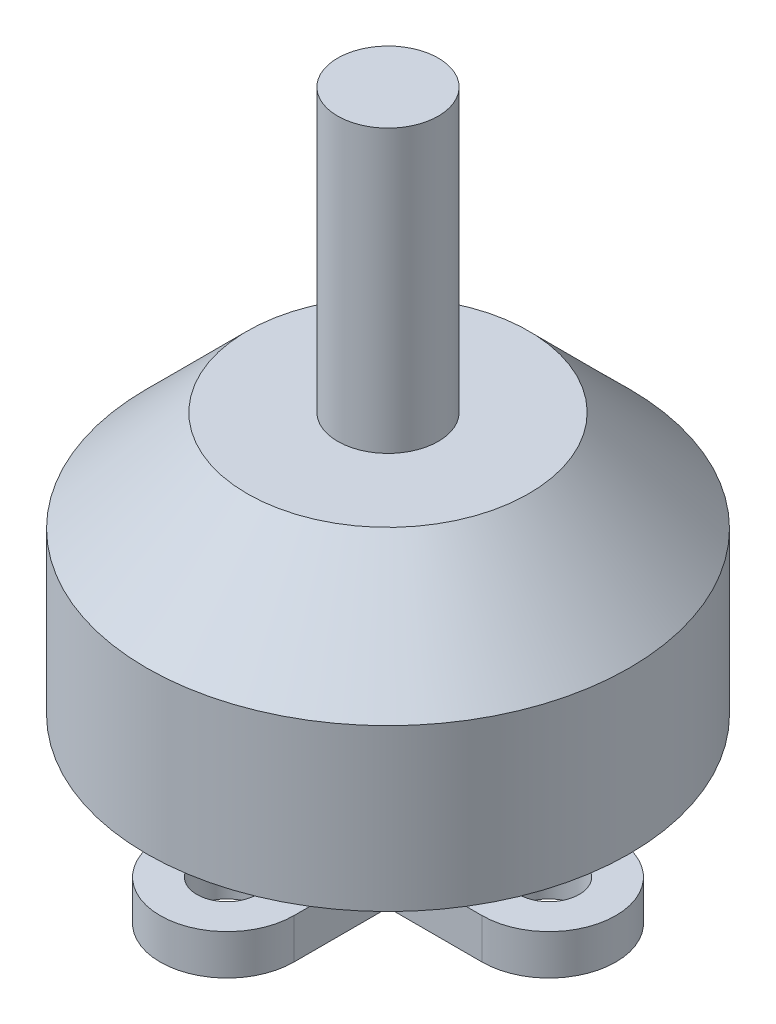
ISO-10303-21;
HEADER;
FILE_DESCRIPTION(('STEP AP214'),'2;1');
FILE_NAME('part.step','',(''),(''),'','','');
FILE_SCHEMA(('AUTOMOTIVE_DESIGN { 1 0 10303 214 1 1 1 1 }'));
ENDSEC;
DATA;
#1=APPLICATION_CONTEXT('core data for automotive mechanical design processes');
#2=APPLICATION_PROTOCOL_DEFINITION('international standard','automotive_design',2000,#1);
#3=PRODUCT_CONTEXT('',#1,'mechanical');
#4=PRODUCT('Part','Part','',(#3));
#5=PRODUCT_RELATED_PRODUCT_CATEGORY('part','',(#4));
#6=PRODUCT_DEFINITION_FORMATION('','',#4);
#7=PRODUCT_DEFINITION_CONTEXT('part definition',#1,'design');
#8=PRODUCT_DEFINITION('design','',#6,#7);
#9=PRODUCT_DEFINITION_SHAPE('','',#8);
#10=(LENGTH_UNIT() NAMED_UNIT(*) SI_UNIT(.MILLI.,.METRE.));
#11=(NAMED_UNIT(*) PLANE_ANGLE_UNIT() SI_UNIT($,.RADIAN.));
#12=(NAMED_UNIT(*) SI_UNIT($,.STERADIAN.) SOLID_ANGLE_UNIT());
#13=UNCERTAINTY_MEASURE_WITH_UNIT(LENGTH_MEASURE(1.E-05),#10,'distance_accuracy_value','');
#14=(GEOMETRIC_REPRESENTATION_CONTEXT(3) GLOBAL_UNCERTAINTY_ASSIGNED_CONTEXT((#13)) GLOBAL_UNIT_ASSIGNED_CONTEXT((#10,
#11,#12)) REPRESENTATION_CONTEXT('',''));
#15=CARTESIAN_POINT('',(0.,0.,0.));
#16=DIRECTION('',(0.,0.,1.));
#17=DIRECTION('',(1.,0.,0.));
#18=AXIS2_PLACEMENT_3D('',#15,#16,#17);
#19=CARTESIAN_POINT('',(0.,2.,0.));
#20=DIRECTION('',(0.,1.,0.));
#21=DIRECTION('',(0.,0.,1.));
#22=AXIS2_PLACEMENT_3D('',#19,#20,#21);
#23=PLANE('',#22);
#24=CARTESIAN_POINT('',(0.,2.,0.));
#25=DIRECTION('',(0.,1.,0.));
#26=DIRECTION('',(0.,0.,1.));
#27=AXIS2_PLACEMENT_3D('',#24,#25,#26);
#28=CIRCLE('',#27,4.6954962251594);
#29=CARTESIAN_POINT('',(3.320217221846,2.,3.32021722184609));
#30=VERTEX_POINT('',#29);
#31=CARTESIAN_POINT('',(3.32021722184605,2.,-3.32021722184604));
#32=VERTEX_POINT('',#31);
#33=EDGE_CURVE('E150',#30,#32,#28,.T.);
#34=ORIENTED_EDGE('',*,*,#33,.F.);
#35=DIRECTION('',(-1.,0.,0.));
#36=VECTOR('',#35,1.);
#37=CARTESIAN_POINT('',(0.,2.,3.32021722184614));
#38=LINE('',#37,#36);
#39=CARTESIAN_POINT('',(7.99999999999994,2.,3.32021722184594));
#40=VERTEX_POINT('',#39);
#41=EDGE_CURVE('E200',#40,#30,#38,.T.);
#42=ORIENTED_EDGE('',*,*,#41,.F.);
#43=CARTESIAN_POINT('',(8.,2.,0.));
#44=DIRECTION('',(0.,1.,0.));
#45=DIRECTION('',(0.,0.,1.));
#46=AXIS2_PLACEMENT_3D('',#43,#44,#45);
#47=CIRCLE('',#46,3.32021722184605);
#48=CARTESIAN_POINT('',(8.00000000000006,2.,-3.32021722184616));
#49=VERTEX_POINT('',#48);
#50=EDGE_CURVE('E202',#40,#49,#47,.T.);
#51=ORIENTED_EDGE('',*,*,#50,.T.);
#52=DIRECTION('',(-1.,0.,0.));
#53=VECTOR('',#52,1.);
#54=CARTESIAN_POINT('',(0.,2.,-3.32021722184596));
#55=LINE('',#54,#53);
#56=EDGE_CURVE('E205',#49,#32,#55,.T.);
#57=ORIENTED_EDGE('',*,*,#56,.T.);
#58=EDGE_LOOP('',(#34,#42,#51,#57));
#59=FACE_BOUND('',#58,.T.);
#60=CARTESIAN_POINT('',(8.,2.,0.));
#61=DIRECTION('',(0.,1.,0.));
#62=DIRECTION('',(0.,0.,1.));
#63=AXIS2_PLACEMENT_3D('',#60,#61,#62);
#64=CIRCLE('',#63,1.5);
#65=CARTESIAN_POINT('',(8.,2.,1.50000000000006));
#66=VERTEX_POINT('',#65);
#67=EDGE_CURVE('E194',#66,#66,#64,.T.);
#68=ORIENTED_EDGE('',*,*,#67,.F.);
#69=EDGE_LOOP('',(#68));
#70=FACE_BOUND('',#69,.T.);
#71=ADVANCED_FACE('F40',(#59,#70),#23,.T.);
#72=CARTESIAN_POINT('',(-3.32021722184605,2.,-3.32021722184611));
#73=VERTEX_POINT('',#72);
#74=EDGE_CURVE('E181',#32,#73,#28,.T.);
#75=ORIENTED_EDGE('',*,*,#74,.F.);
#76=DIRECTION('',(0.,0.,-1.));
#77=VECTOR('',#76,1.);
#78=CARTESIAN_POINT('',(3.32021722184602,2.,0.));
#79=LINE('',#78,#77);
#80=CARTESIAN_POINT('',(3.32021722184619,2.,-7.99999999999995));
#81=VERTEX_POINT('',#80);
#82=EDGE_CURVE('E208',#32,#81,#79,.T.);
#83=ORIENTED_EDGE('',*,*,#82,.T.);
#84=CARTESIAN_POINT('',(0.,2.,-8.));
#85=DIRECTION('',(0.,1.,0.));
#86=DIRECTION('',(0.,0.,1.));
#87=AXIS2_PLACEMENT_3D('',#84,#85,#86);
#88=CIRCLE('',#87,3.32021722184605);
#89=CARTESIAN_POINT('',(-3.32021722184591,2.,-8.00000000000004));
#90=VERTEX_POINT('',#89);
#91=EDGE_CURVE('E211',#81,#90,#88,.T.);
#92=ORIENTED_EDGE('',*,*,#91,.T.);
#93=DIRECTION('',(0.,0.,1.));
#94=VECTOR('',#93,1.);
#95=CARTESIAN_POINT('',(-3.32021722184616,2.,-1.02521717049406E-13));
#96=LINE('',#95,#94);
#97=EDGE_CURVE('E214',#90,#73,#96,.T.);
#98=ORIENTED_EDGE('',*,*,#97,.T.);
#99=EDGE_LOOP('',(#75,#83,#92,#98));
#100=FACE_BOUND('',#99,.T.);
#101=CARTESIAN_POINT('',(0.,2.,-8.));
#102=DIRECTION('',(0.,1.,0.));
#103=DIRECTION('',(0.,0.,1.));
#104=AXIS2_PLACEMENT_3D('',#101,#102,#103);
#105=CIRCLE('',#104,1.5);
#106=CARTESIAN_POINT('',(0.,2.,-6.5));
#107=VERTEX_POINT('',#106);
#108=EDGE_CURVE('E191',#107,#107,#105,.T.);
#109=ORIENTED_EDGE('',*,*,#108,.F.);
#110=EDGE_LOOP('',(#109));
#111=FACE_BOUND('',#110,.T.);
#112=ADVANCED_FACE('F311',(#100,#111),#23,.T.);
#113=CARTESIAN_POINT('',(-3.3202172218461,2.,3.32021722184599));
#114=VERTEX_POINT('',#113);
#115=EDGE_CURVE('E148',#73,#114,#28,.T.);
#116=ORIENTED_EDGE('',*,*,#115,.F.);
#117=DIRECTION('',(-1.,0.,0.));
#118=VECTOR('',#117,1.);
#119=CARTESIAN_POINT('',(0.,2.,-3.32021722184608));
#120=LINE('',#119,#118);
#121=CARTESIAN_POINT('',(-7.99999999999997,2.,-3.32021722184616));
#122=VERTEX_POINT('',#121);
#123=EDGE_CURVE('E217',#73,#122,#120,.T.);
#124=ORIENTED_EDGE('',*,*,#123,.T.);
#125=CARTESIAN_POINT('',(-8.,2.,-1.1172740284298E-13));
#126=DIRECTION('',(0.,1.,0.));
#127=DIRECTION('',(0.,0.,1.));
#128=AXIS2_PLACEMENT_3D('',#125,#126,#127);
#129=CIRCLE('',#128,3.32021722184605);
#130=CARTESIAN_POINT('',(-8.00000000000004,2.,3.32021722184594));
#131=VERTEX_POINT('',#130);
#132=EDGE_CURVE('E170',#122,#131,#129,.T.);
#133=ORIENTED_EDGE('',*,*,#132,.T.);
#134=DIRECTION('',(1.,0.,0.));
#135=VECTOR('',#134,1.);
#136=CARTESIAN_POINT('',(0.,2.,3.32021722184602));
#137=LINE('',#136,#135);
#138=EDGE_CURVE('E162',#131,#114,#137,.T.);
#139=ORIENTED_EDGE('',*,*,#138,.T.);
#140=EDGE_LOOP('',(#116,#124,#133,#139));
#141=FACE_BOUND('',#140,.T.);
#142=CARTESIAN_POINT('',(-8.,2.,0.));
#143=DIRECTION('',(0.,1.,0.));
#144=DIRECTION('',(0.,0.,1.));
#145=AXIS2_PLACEMENT_3D('',#142,#143,#144);
#146=CIRCLE('',#145,1.5);
#147=CARTESIAN_POINT('',(-8.,2.,1.5));
#148=VERTEX_POINT('',#147);
#149=EDGE_CURVE('E188',#148,#148,#146,.T.);
#150=ORIENTED_EDGE('',*,*,#149,.F.);
#151=EDGE_LOOP('',(#150));
#152=FACE_BOUND('',#151,.T.);
#153=ADVANCED_FACE('F166',(#141,#152),#23,.T.);
#154=CARTESIAN_POINT('',(0.,2.,3.32021722184614));
#155=DIRECTION('',(0.,0.,1.));
#156=DIRECTION('',(1.,0.,0.));
#157=AXIS2_PLACEMENT_3D('',#154,#155,#156);
#158=PLANE('',#157);
#159=DIRECTION('',(-1.,0.,0.));
#160=VECTOR('',#159,1.);
#161=CARTESIAN_POINT('',(0.,0.,3.32021722184614));
#162=LINE('',#161,#160);
#163=CARTESIAN_POINT('',(7.99999999999994,0.,3.32021722184594));
#164=VERTEX_POINT('',#163);
#165=CARTESIAN_POINT('',(3.320217221846,0.,3.32021722184606));
#166=VERTEX_POINT('',#165);
#167=EDGE_CURVE('E234',#164,#166,#162,.T.);
#168=ORIENTED_EDGE('',*,*,#167,.F.);
#169=DIRECTION('',(0.,-1.,0.));
#170=VECTOR('',#169,1.);
#171=CARTESIAN_POINT('',(7.99999999999994,2.,3.32021722184594));
#172=LINE('',#171,#170);
#173=EDGE_CURVE('E111',#40,#164,#172,.T.);
#174=ORIENTED_EDGE('',*,*,#173,.F.);
#175=ORIENTED_EDGE('',*,*,#41,.T.);
#176=DIRECTION('',(0.,-1.,0.));
#177=VECTOR('',#176,1.);
#178=CARTESIAN_POINT('',(3.320217221846,2.,3.32021722184606));
#179=LINE('',#178,#177);
#180=EDGE_CURVE('E107',#30,#166,#179,.T.);
#181=ORIENTED_EDGE('',*,*,#180,.T.);
#182=EDGE_LOOP('',(#168,#174,#175,#181));
#183=FACE_BOUND('',#182,.T.);
#184=ADVANCED_FACE('F332',(#183),#158,.T.);
#185=CARTESIAN_POINT('',(8.,2.,0.));
#186=DIRECTION('',(0.,-1.,0.));
#187=DIRECTION('',(0.,0.,-1.));
#188=AXIS2_PLACEMENT_3D('',#185,#186,#187);
#189=CYLINDRICAL_SURFACE('',#188,3.32021722184605);
#190=CARTESIAN_POINT('',(8.,0.,0.));
#191=DIRECTION('',(0.,1.,0.));
#192=DIRECTION('',(0.,0.,1.));
#193=AXIS2_PLACEMENT_3D('',#190,#191,#192);
#194=CIRCLE('',#193,3.32021722184605);
#195=CARTESIAN_POINT('',(8.00000000000006,0.,-3.32021722184616));
#196=VERTEX_POINT('',#195);
#197=EDGE_CURVE('E236',#164,#196,#194,.T.);
#198=ORIENTED_EDGE('',*,*,#197,.T.);
#199=DIRECTION('',(0.,-1.,0.));
#200=VECTOR('',#199,1.);
#201=CARTESIAN_POINT('',(8.00000000000006,2.,-3.32021722184616));
#202=LINE('',#201,#200);
#203=EDGE_CURVE('E284',#49,#196,#202,.T.);
#204=ORIENTED_EDGE('',*,*,#203,.F.);
#205=ORIENTED_EDGE('',*,*,#50,.F.);
#206=ORIENTED_EDGE('',*,*,#173,.T.);
#207=EDGE_LOOP('',(#198,#204,#205,#206));
#208=FACE_BOUND('',#207,.T.);
#209=ADVANCED_FACE('F336',(#208),#189,.T.);
#210=CARTESIAN_POINT('',(0.,2.,-3.32021722184596));
#211=DIRECTION('',(0.,0.,1.));
#212=DIRECTION('',(1.,0.,0.));
#213=AXIS2_PLACEMENT_3D('',#210,#211,#212);
#214=PLANE('',#213);
#215=DIRECTION('',(-1.,0.,0.));
#216=VECTOR('',#215,1.);
#217=CARTESIAN_POINT('',(0.,0.,-3.32021722184596));
#218=LINE('',#217,#216);
#219=CARTESIAN_POINT('',(3.32021722184605,0.,-3.32021722184604));
#220=VERTEX_POINT('',#219);
#221=EDGE_CURVE('E239',#196,#220,#218,.T.);
#222=ORIENTED_EDGE('',*,*,#221,.T.);
#223=DIRECTION('',(0.,-1.,0.));
#224=VECTOR('',#223,1.);
#225=CARTESIAN_POINT('',(3.32021722184605,2.,-3.32021722184604));
#226=LINE('',#225,#224);
#227=EDGE_CURVE('E281',#32,#220,#226,.T.);
#228=ORIENTED_EDGE('',*,*,#227,.F.);
#229=ORIENTED_EDGE('',*,*,#56,.F.);
#230=ORIENTED_EDGE('',*,*,#203,.T.);
#231=EDGE_LOOP('',(#222,#228,#229,#230));
#232=FACE_BOUND('',#231,.T.);
#233=ADVANCED_FACE('F341',(#232),#214,.F.);
#234=CARTESIAN_POINT('',(3.32021722184602,2.,0.));
#235=DIRECTION('',(-1.,0.,0.));
#236=DIRECTION('',(0.,0.,1.));
#237=AXIS2_PLACEMENT_3D('',#234,#235,#236);
#238=PLANE('',#237);
#239=DIRECTION('',(0.,0.,-1.));
#240=VECTOR('',#239,1.);
#241=CARTESIAN_POINT('',(3.32021722184602,0.,0.));
#242=LINE('',#241,#240);
#243=CARTESIAN_POINT('',(3.32021722184619,0.,-7.99999999999995));
#244=VERTEX_POINT('',#243);
#245=EDGE_CURVE('E242',#220,#244,#242,.T.);
#246=ORIENTED_EDGE('',*,*,#245,.T.);
#247=DIRECTION('',(0.,-1.,0.));
#248=VECTOR('',#247,1.);
#249=CARTESIAN_POINT('',(3.32021722184619,2.,-7.99999999999995));
#250=LINE('',#249,#248);
#251=EDGE_CURVE('E278',#81,#244,#250,.T.);
#252=ORIENTED_EDGE('',*,*,#251,.F.);
#253=ORIENTED_EDGE('',*,*,#82,.F.);
#254=ORIENTED_EDGE('',*,*,#227,.T.);
#255=EDGE_LOOP('',(#246,#252,#253,#254));
#256=FACE_BOUND('',#255,.T.);
#257=ADVANCED_FACE('F390',(#256),#238,.F.);
#258=CARTESIAN_POINT('',(0.,2.,-8.));
#259=DIRECTION('',(0.,-1.,0.));
#260=DIRECTION('',(0.,0.,-1.));
#261=AXIS2_PLACEMENT_3D('',#258,#259,#260);
#262=CYLINDRICAL_SURFACE('',#261,3.32021722184605);
#263=CARTESIAN_POINT('',(0.,0.,-8.));
#264=DIRECTION('',(0.,1.,0.));
#265=DIRECTION('',(0.,0.,1.));
#266=AXIS2_PLACEMENT_3D('',#263,#264,#265);
#267=CIRCLE('',#266,3.32021722184605);
#268=CARTESIAN_POINT('',(-3.32021722184591,0.,-8.00000000000004));
#269=VERTEX_POINT('',#268);
#270=EDGE_CURVE('E245',#244,#269,#267,.T.);
#271=ORIENTED_EDGE('',*,*,#270,.T.);
#272=DIRECTION('',(0.,-1.,0.));
#273=VECTOR('',#272,1.);
#274=CARTESIAN_POINT('',(-3.32021722184591,2.,-8.00000000000004));
#275=LINE('',#274,#273);
#276=EDGE_CURVE('E275',#90,#269,#275,.T.);
#277=ORIENTED_EDGE('',*,*,#276,.F.);
#278=ORIENTED_EDGE('',*,*,#91,.F.);
#279=ORIENTED_EDGE('',*,*,#251,.T.);
#280=EDGE_LOOP('',(#271,#277,#278,#279));
#281=FACE_BOUND('',#280,.T.);
#282=ADVANCED_FACE('F386',(#281),#262,.T.);
#283=CARTESIAN_POINT('',(-3.32021722184616,2.,-1.02521717049406E-13));
#284=DIRECTION('',(1.,0.,0.));
#285=DIRECTION('',(0.,0.,-1.));
#286=AXIS2_PLACEMENT_3D('',#283,#284,#285);
#287=PLANE('',#286);
#288=DIRECTION('',(0.,0.,1.));
#289=VECTOR('',#288,1.);
#290=CARTESIAN_POINT('',(-3.32021722184616,0.,-1.02521717049406E-13));
#291=LINE('',#290,#289);
#292=CARTESIAN_POINT('',(-3.32021722184605,0.,-3.32021722184611));
#293=VERTEX_POINT('',#292);
#294=EDGE_CURVE('E248',#269,#293,#291,.T.);
#295=ORIENTED_EDGE('',*,*,#294,.T.);
#296=DIRECTION('',(0.,-1.,0.));
#297=VECTOR('',#296,1.);
#298=CARTESIAN_POINT('',(-3.32021722184605,2.,-3.32021722184611));
#299=LINE('',#298,#297);
#300=EDGE_CURVE('E272',#73,#293,#299,.T.);
#301=ORIENTED_EDGE('',*,*,#300,.F.);
#302=ORIENTED_EDGE('',*,*,#97,.F.);
#303=ORIENTED_EDGE('',*,*,#276,.T.);
#304=EDGE_LOOP('',(#295,#301,#302,#303));
#305=FACE_BOUND('',#304,.T.);
#306=ADVANCED_FACE('F384',(#305),#287,.F.);
#307=CARTESIAN_POINT('',(0.,2.,-3.32021722184608));
#308=DIRECTION('',(0.,0.,1.));
#309=DIRECTION('',(1.,0.,0.));
#310=AXIS2_PLACEMENT_3D('',#307,#308,#309);
#311=PLANE('',#310);
#312=DIRECTION('',(-1.,0.,0.));
#313=VECTOR('',#312,1.);
#314=CARTESIAN_POINT('',(0.,0.,-3.32021722184608));
#315=LINE('',#314,#313);
#316=CARTESIAN_POINT('',(-7.99999999999997,0.,-3.32021722184616));
#317=VERTEX_POINT('',#316);
#318=EDGE_CURVE('E251',#293,#317,#315,.T.);
#319=ORIENTED_EDGE('',*,*,#318,.T.);
#320=DIRECTION('',(0.,-1.,0.));
#321=VECTOR('',#320,1.);
#322=CARTESIAN_POINT('',(-7.99999999999997,2.,-3.32021722184616));
#323=LINE('',#322,#321);
#324=EDGE_CURVE('E269',#122,#317,#323,.T.);
#325=ORIENTED_EDGE('',*,*,#324,.F.);
#326=ORIENTED_EDGE('',*,*,#123,.F.);
#327=ORIENTED_EDGE('',*,*,#300,.T.);
#328=EDGE_LOOP('',(#319,#325,#326,#327));
#329=FACE_BOUND('',#328,.T.);
#330=ADVANCED_FACE('F380',(#329),#311,.F.);
#331=CARTESIAN_POINT('',(-8.,2.,-1.1172740284298E-13));
#332=DIRECTION('',(0.,-1.,0.));
#333=DIRECTION('',(0.,0.,-1.));
#334=AXIS2_PLACEMENT_3D('',#331,#332,#333);
#335=CYLINDRICAL_SURFACE('',#334,3.32021722184605);
#336=CARTESIAN_POINT('',(-8.,0.,-1.1172740284298E-13));
#337=DIRECTION('',(0.,1.,0.));
#338=DIRECTION('',(0.,0.,1.));
#339=AXIS2_PLACEMENT_3D('',#336,#337,#338);
#340=CIRCLE('',#339,3.32021722184605);
#341=CARTESIAN_POINT('',(-8.00000000000004,0.,3.32021722184594));
#342=VERTEX_POINT('',#341);
#343=EDGE_CURVE('E254',#317,#342,#340,.T.);
#344=ORIENTED_EDGE('',*,*,#343,.T.);
#345=DIRECTION('',(0.,-1.,0.));
#346=VECTOR('',#345,1.);
#347=CARTESIAN_POINT('',(-8.00000000000004,2.,3.32021722184594));
#348=LINE('',#347,#346);
#349=EDGE_CURVE('E177',#131,#342,#348,.T.);
#350=ORIENTED_EDGE('',*,*,#349,.F.);
#351=ORIENTED_EDGE('',*,*,#132,.F.);
#352=ORIENTED_EDGE('',*,*,#324,.T.);
#353=EDGE_LOOP('',(#344,#350,#351,#352));
#354=FACE_BOUND('',#353,.T.);
#355=ADVANCED_FACE('F377',(#354),#335,.T.);
#356=CARTESIAN_POINT('',(0.,2.,3.32021722184602));
#357=DIRECTION('',(0.,0.,-1.));
#358=DIRECTION('',(-1.,0.,0.));
#359=AXIS2_PLACEMENT_3D('',#356,#357,#358);
#360=PLANE('',#359);
#361=DIRECTION('',(1.,0.,0.));
#362=VECTOR('',#361,1.);
#363=CARTESIAN_POINT('',(0.,0.,3.32021722184602));
#364=LINE('',#363,#362);
#365=CARTESIAN_POINT('',(-3.3202172218461,0.,3.32021722184599));
#366=VERTEX_POINT('',#365);
#367=EDGE_CURVE('E176',#342,#366,#364,.T.);
#368=ORIENTED_EDGE('',*,*,#367,.T.);
#369=DIRECTION('',(0.,-1.,0.));
#370=VECTOR('',#369,1.);
#371=CARTESIAN_POINT('',(-3.3202172218461,2.,3.32021722184599));
#372=LINE('',#371,#370);
#373=EDGE_CURVE('E157',#114,#366,#372,.T.);
#374=ORIENTED_EDGE('',*,*,#373,.F.);
#375=ORIENTED_EDGE('',*,*,#138,.F.);
#376=ORIENTED_EDGE('',*,*,#349,.T.);
#377=EDGE_LOOP('',(#368,#374,#375,#376));
#378=FACE_BOUND('',#377,.T.);
#379=ADVANCED_FACE('F175',(#378),#360,.F.);
#380=CARTESIAN_POINT('',(-3.32021722184608,2.,0.));
#381=DIRECTION('',(1.,0.,0.));
#382=DIRECTION('',(0.,0.,-1.));
#383=AXIS2_PLACEMENT_3D('',#380,#381,#382);
#384=PLANE('',#383);
#385=DIRECTION('',(0.,0.,1.));
#386=VECTOR('',#385,1.);
#387=CARTESIAN_POINT('',(-3.32021722184608,0.,0.));
#388=LINE('',#387,#386);
#389=CARTESIAN_POINT('',(-3.32021722184613,0.,7.99999999999998));
#390=VERTEX_POINT('',#389);
#391=EDGE_CURVE('E258',#366,#390,#388,.T.);
#392=ORIENTED_EDGE('',*,*,#391,.T.);
#393=DIRECTION('',(0.,-1.,0.));
#394=VECTOR('',#393,1.);
#395=CARTESIAN_POINT('',(-3.32021722184613,2.,7.99999999999998));
#396=LINE('',#395,#394);
#397=CARTESIAN_POINT('',(-3.32021722184613,2.,7.99999999999998));
#398=VERTEX_POINT('',#397);
#399=EDGE_CURVE('E160',#398,#390,#396,.T.);
#400=ORIENTED_EDGE('',*,*,#399,.F.);
#401=DIRECTION('',(0.,0.,1.));
#402=VECTOR('',#401,1.);
#403=CARTESIAN_POINT('',(-3.32021722184608,2.,0.));
#404=LINE('',#403,#402);
#405=EDGE_CURVE('E142',#114,#398,#404,.T.);
#406=ORIENTED_EDGE('',*,*,#405,.F.);
#407=ORIENTED_EDGE('',*,*,#373,.T.);
#408=EDGE_LOOP('',(#392,#400,#406,#407));
#409=FACE_BOUND('',#408,.T.);
#410=ADVANCED_FACE('F155',(#409),#384,.F.);
#411=CARTESIAN_POINT('',(0.,2.,8.));
#412=DIRECTION('',(0.,-1.,0.));
#413=DIRECTION('',(0.,0.,-1.));
#414=AXIS2_PLACEMENT_3D('',#411,#412,#413);
#415=CYLINDRICAL_SURFACE('',#414,3.32021722184605);
#416=CARTESIAN_POINT('',(0.,0.,8.));
#417=DIRECTION('',(0.,1.,0.));
#418=DIRECTION('',(0.,0.,1.));
#419=AXIS2_PLACEMENT_3D('',#416,#417,#418);
#420=CIRCLE('',#419,3.32021722184605);
#421=CARTESIAN_POINT('',(3.32021722184597,0.,8.00000000000002));
#422=VERTEX_POINT('',#421);
#423=EDGE_CURVE('E260',#390,#422,#420,.T.);
#424=ORIENTED_EDGE('',*,*,#423,.T.);
#425=DIRECTION('',(0.,-1.,0.));
#426=VECTOR('',#425,1.);
#427=CARTESIAN_POINT('',(3.32021722184597,2.,8.00000000000002));
#428=LINE('',#427,#426);
#429=CARTESIAN_POINT('',(3.32021722184597,2.,8.00000000000002));
#430=VERTEX_POINT('',#429);
#431=EDGE_CURVE('E265',#430,#422,#428,.T.);
#432=ORIENTED_EDGE('',*,*,#431,.F.);
#433=CARTESIAN_POINT('',(0.,2.,8.));
#434=DIRECTION('',(0.,1.,0.));
#435=DIRECTION('',(0.,0.,1.));
#436=AXIS2_PLACEMENT_3D('',#433,#434,#435);
#437=CIRCLE('',#436,3.32021722184605);
#438=EDGE_CURVE('E161',#398,#430,#437,.T.);
#439=ORIENTED_EDGE('',*,*,#438,.F.);
#440=ORIENTED_EDGE('',*,*,#399,.T.);
#441=EDGE_LOOP('',(#424,#432,#439,#440));
#442=FACE_BOUND('',#441,.T.);
#443=ADVANCED_FACE('F350',(#442),#415,.T.);
#444=CARTESIAN_POINT('',(0.,2.,8.));
#445=DIRECTION('',(0.,-1.,0.));
#446=DIRECTION('',(0.,0.,-1.));
#447=AXIS2_PLACEMENT_3D('',#444,#445,#446);
#448=CYLINDRICAL_SURFACE('',#447,1.5);
#449=CARTESIAN_POINT('',(0.,2.,8.));
#450=DIRECTION('',(0.,1.,0.));
#451=DIRECTION('',(0.,0.,1.));
#452=AXIS2_PLACEMENT_3D('',#449,#450,#451);
#453=CIRCLE('',#452,1.5);
#454=CARTESIAN_POINT('',(0.,2.,9.5));
#455=VERTEX_POINT('',#454);
#456=EDGE_CURVE('E197',#455,#455,#453,.T.);
#457=ORIENTED_EDGE('',*,*,#456,.T.);
#458=EDGE_LOOP('',(#457));
#459=FACE_BOUND('',#458,.T.);
#460=CARTESIAN_POINT('',(0.,0.,8.));
#461=DIRECTION('',(0.,1.,0.));
#462=DIRECTION('',(0.,0.,1.));
#463=AXIS2_PLACEMENT_3D('',#460,#461,#462);
#464=CIRCLE('',#463,1.5);
#465=CARTESIAN_POINT('',(0.,0.,9.5));
#466=VERTEX_POINT('',#465);
#467=EDGE_CURVE('E231',#466,#466,#464,.T.);
#468=ORIENTED_EDGE('',*,*,#467,.F.);
#469=EDGE_LOOP('',(#468));
#470=FACE_BOUND('',#469,.T.);
#471=ADVANCED_FACE('F346',(#459,#470),#448,.F.);
#472=CARTESIAN_POINT('',(8.,2.,0.));
#473=DIRECTION('',(0.,-1.,0.));
#474=DIRECTION('',(0.,0.,-1.));
#475=AXIS2_PLACEMENT_3D('',#472,#473,#474);
#476=CYLINDRICAL_SURFACE('',#475,1.5);
#477=ORIENTED_EDGE('',*,*,#67,.T.);
#478=EDGE_LOOP('',(#477));
#479=FACE_BOUND('',#478,.T.);
#480=CARTESIAN_POINT('',(8.,0.,0.));
#481=DIRECTION('',(0.,1.,0.));
#482=DIRECTION('',(0.,0.,1.));
#483=AXIS2_PLACEMENT_3D('',#480,#481,#482);
#484=CIRCLE('',#483,1.5);
#485=CARTESIAN_POINT('',(8.,0.,1.50000000000006));
#486=VERTEX_POINT('',#485);
#487=EDGE_CURVE('E228',#486,#486,#484,.T.);
#488=ORIENTED_EDGE('',*,*,#487,.F.);
#489=EDGE_LOOP('',(#488));
#490=FACE_BOUND('',#489,.T.);
#491=ADVANCED_FACE('F349',(#479,#490),#476,.F.);
#492=CARTESIAN_POINT('',(0.,2.,-8.));
#493=DIRECTION('',(0.,-1.,0.));
#494=DIRECTION('',(0.,0.,-1.));
#495=AXIS2_PLACEMENT_3D('',#492,#493,#494);
#496=CYLINDRICAL_SURFACE('',#495,1.5);
#497=ORIENTED_EDGE('',*,*,#108,.T.);
#498=EDGE_LOOP('',(#497));
#499=FACE_BOUND('',#498,.T.);
#500=CARTESIAN_POINT('',(0.,0.,-8.));
#501=DIRECTION('',(0.,1.,0.));
#502=DIRECTION('',(0.,0.,1.));
#503=AXIS2_PLACEMENT_3D('',#500,#501,#502);
#504=CIRCLE('',#503,1.5);
#505=CARTESIAN_POINT('',(0.,0.,-6.5));
#506=VERTEX_POINT('',#505);
#507=EDGE_CURVE('E225',#506,#506,#504,.T.);
#508=ORIENTED_EDGE('',*,*,#507,.F.);
#509=EDGE_LOOP('',(#508));
#510=FACE_BOUND('',#509,.T.);
#511=ADVANCED_FACE('F354',(#499,#510),#496,.F.);
#512=CARTESIAN_POINT('',(-8.,2.,0.));
#513=DIRECTION('',(0.,-1.,0.));
#514=DIRECTION('',(0.,0.,-1.));
#515=AXIS2_PLACEMENT_3D('',#512,#513,#514);
#516=CYLINDRICAL_SURFACE('',#515,1.5);
#517=ORIENTED_EDGE('',*,*,#149,.T.);
#518=EDGE_LOOP('',(#517));
#519=FACE_BOUND('',#518,.T.);
#520=CARTESIAN_POINT('',(-8.,0.,0.));
#521=DIRECTION('',(0.,1.,0.));
#522=DIRECTION('',(0.,0.,1.));
#523=AXIS2_PLACEMENT_3D('',#520,#521,#522);
#524=CIRCLE('',#523,1.5);
#525=CARTESIAN_POINT('',(-8.,0.,1.5));
#526=VERTEX_POINT('',#525);
#527=EDGE_CURVE('E222',#526,#526,#524,.T.);
#528=ORIENTED_EDGE('',*,*,#527,.F.);
#529=EDGE_LOOP('',(#528));
#530=FACE_BOUND('',#529,.T.);
#531=ADVANCED_FACE('F329',(#519,#530),#516,.F.);
#532=CARTESIAN_POINT('',(3.32021722184602,2.,0.));
#533=DIRECTION('',(-1.,0.,0.));
#534=DIRECTION('',(0.,0.,1.));
#535=AXIS2_PLACEMENT_3D('',#532,#533,#534);
#536=PLANE('',#535);
#537=DIRECTION('',(0.,0.,-1.));
#538=VECTOR('',#537,1.);
#539=CARTESIAN_POINT('',(3.32021722184602,0.,0.));
#540=LINE('',#539,#538);
#541=EDGE_CURVE('E101',#422,#166,#540,.T.);
#542=ORIENTED_EDGE('',*,*,#541,.T.);
#543=ORIENTED_EDGE('',*,*,#180,.F.);
#544=DIRECTION('',(0.,0.,-1.));
#545=VECTOR('',#544,1.);
#546=CARTESIAN_POINT('',(3.32021722184602,2.,0.));
#547=LINE('',#546,#545);
#548=EDGE_CURVE('E59',#430,#30,#547,.T.);
#549=ORIENTED_EDGE('',*,*,#548,.F.);
#550=ORIENTED_EDGE('',*,*,#431,.T.);
#551=EDGE_LOOP('',(#542,#543,#549,#550));
#552=FACE_BOUND('',#551,.T.);
#553=ADVANCED_FACE('F323',(#552),#536,.F.);
#554=EDGE_CURVE('E138',#114,#30,#28,.T.);
#555=ORIENTED_EDGE('',*,*,#554,.F.);
#556=ORIENTED_EDGE('',*,*,#405,.T.);
#557=ORIENTED_EDGE('',*,*,#438,.T.);
#558=ORIENTED_EDGE('',*,*,#548,.T.);
#559=EDGE_LOOP('',(#555,#556,#557,#558));
#560=FACE_BOUND('',#559,.T.);
#561=ORIENTED_EDGE('',*,*,#456,.F.);
#562=EDGE_LOOP('',(#561));
#563=FACE_BOUND('',#562,.T.);
#564=ADVANCED_FACE('F140',(#560,#563),#23,.T.);
#565=CARTESIAN_POINT('',(0.,0.,0.));
#566=DIRECTION('',(0.,1.,0.));
#567=DIRECTION('',(0.,0.,1.));
#568=AXIS2_PLACEMENT_3D('',#565,#566,#567);
#569=PLANE('',#568);
#570=ORIENTED_EDGE('',*,*,#527,.T.);
#571=EDGE_LOOP('',(#570));
#572=FACE_BOUND('',#571,.T.);
#573=ORIENTED_EDGE('',*,*,#507,.T.);
#574=EDGE_LOOP('',(#573));
#575=FACE_BOUND('',#574,.T.);
#576=ORIENTED_EDGE('',*,*,#487,.T.);
#577=EDGE_LOOP('',(#576));
#578=FACE_BOUND('',#577,.T.);
#579=ORIENTED_EDGE('',*,*,#467,.T.);
#580=EDGE_LOOP('',(#579));
#581=FACE_BOUND('',#580,.T.);
#582=ORIENTED_EDGE('',*,*,#167,.T.);
#583=ORIENTED_EDGE('',*,*,#541,.F.);
#584=ORIENTED_EDGE('',*,*,#423,.F.);
#585=ORIENTED_EDGE('',*,*,#391,.F.);
#586=ORIENTED_EDGE('',*,*,#367,.F.);
#587=ORIENTED_EDGE('',*,*,#343,.F.);
#588=ORIENTED_EDGE('',*,*,#318,.F.);
#589=ORIENTED_EDGE('',*,*,#294,.F.);
#590=ORIENTED_EDGE('',*,*,#270,.F.);
#591=ORIENTED_EDGE('',*,*,#245,.F.);
#592=ORIENTED_EDGE('',*,*,#221,.F.);
#593=ORIENTED_EDGE('',*,*,#197,.F.);
#594=EDGE_LOOP('',(#582,#583,#584,#585,#586,#587,#588,#589,#590,#591,#592,#593));
#595=FACE_BOUND('',#594,.T.);
#596=ADVANCED_FACE('F322',(#572,#575,#578,#581,#595),#569,.F.);
#597=CARTESIAN_POINT('',(0.,5.,0.));
#598=DIRECTION('',(0.,-1.,0.));
#599=DIRECTION('',(0.,0.,-1.));
#600=AXIS2_PLACEMENT_3D('',#597,#598,#599);
#601=CYLINDRICAL_SURFACE('',#600,4.6954962251594);
#602=CARTESIAN_POINT('',(0.,5.,0.));
#603=DIRECTION('',(0.,1.,0.));
#604=DIRECTION('',(0.,0.,1.));
#605=AXIS2_PLACEMENT_3D('',#602,#603,#604);
#606=CIRCLE('',#605,4.6954962251594);
#607=CARTESIAN_POINT('',(0.,5.,4.6954962251594));
#608=VERTEX_POINT('',#607);
#609=EDGE_CURVE('E185',#608,#608,#606,.T.);
#610=ORIENTED_EDGE('',*,*,#609,.F.);
#611=EDGE_LOOP('',(#610));
#612=FACE_BOUND('',#611,.T.);
#613=ORIENTED_EDGE('',*,*,#33,.T.);
#614=ORIENTED_EDGE('',*,*,#74,.T.);
#615=ORIENTED_EDGE('',*,*,#115,.T.);
#616=ORIENTED_EDGE('',*,*,#554,.T.);
#617=EDGE_LOOP('',(#613,#614,#615,#616));
#618=FACE_BOUND('',#617,.T.);
#619=ADVANCED_FACE('F180',(#612,#618),#601,.T.);
#620=CARTESIAN_POINT('',(0.,18.,0.));
#621=DIRECTION('',(0.,-1.,0.));
#622=DIRECTION('',(0.,0.,-1.));
#623=AXIS2_PLACEMENT_3D('',#620,#621,#622);
#624=CYLINDRICAL_SURFACE('',#623,12.);
#625=CARTESIAN_POINT('',(0.,13.,0.));
#626=DIRECTION('',(0.,1.,0.));
#627=DIRECTION('',(0.,0.,1.));
#628=AXIS2_PLACEMENT_3D('',#625,#626,#627);
#629=CIRCLE('',#628,12.);
#630=CARTESIAN_POINT('',(0.,13.,12.));
#631=VERTEX_POINT('',#630);
#632=EDGE_CURVE('E45',#631,#631,#629,.F.);
#633=ORIENTED_EDGE('',*,*,#632,.T.);
#634=EDGE_LOOP('',(#633));
#635=FACE_BOUND('',#634,.T.);
#636=CARTESIAN_POINT('',(0.,5.,0.));
#637=DIRECTION('',(0.,1.,0.));
#638=DIRECTION('',(0.,0.,1.));
#639=AXIS2_PLACEMENT_3D('',#636,#637,#638);
#640=CIRCLE('',#639,12.);
#641=CARTESIAN_POINT('',(0.,5.,12.));
#642=VERTEX_POINT('',#641);
#643=EDGE_CURVE('E186',#642,#642,#640,.T.);
#644=ORIENTED_EDGE('',*,*,#643,.T.);
#645=EDGE_LOOP('',(#644));
#646=FACE_BOUND('',#645,.T.);
#647=ADVANCED_FACE('F293',(#635,#646),#624,.T.);
#648=CARTESIAN_POINT('',(0.,18.,0.));
#649=DIRECTION('',(0.,1.,0.));
#650=DIRECTION('',(0.,0.,1.));
#651=AXIS2_PLACEMENT_3D('',#648,#649,#650);
#652=PLANE('',#651);
#653=CARTESIAN_POINT('',(0.,18.,0.));
#654=DIRECTION('',(0.,1.,0.));
#655=DIRECTION('',(0.,0.,1.));
#656=AXIS2_PLACEMENT_3D('',#653,#654,#655);
#657=CIRCLE('',#656,2.5);
#658=CARTESIAN_POINT('',(0.,18.,2.5));
#659=VERTEX_POINT('',#658);
#660=EDGE_CURVE('E11',#659,#659,#657,.T.);
#661=ORIENTED_EDGE('',*,*,#660,.F.);
#662=EDGE_LOOP('',(#661));
#663=FACE_BOUND('',#662,.T.);
#664=CARTESIAN_POINT('',(0.,18.,0.));
#665=DIRECTION('',(0.,1.,0.));
#666=DIRECTION('',(0.,0.,1.));
#667=AXIS2_PLACEMENT_3D('',#664,#665,#666);
#668=CIRCLE('',#667,7.00000000000002);
#669=CARTESIAN_POINT('',(0.,18.,7.00000000000002));
#670=VERTEX_POINT('',#669);
#671=EDGE_CURVE('E182',#670,#670,#668,.T.);
#672=ORIENTED_EDGE('',*,*,#671,.T.);
#673=EDGE_LOOP('',(#672));
#674=FACE_BOUND('',#673,.T.);
#675=ADVANCED_FACE('F307',(#663,#674),#652,.T.);
#676=CARTESIAN_POINT('',(0.,5.,0.));
#677=DIRECTION('',(0.,1.,0.));
#678=DIRECTION('',(0.,0.,1.));
#679=AXIS2_PLACEMENT_3D('',#676,#677,#678);
#680=PLANE('',#679);
#681=ORIENTED_EDGE('',*,*,#609,.T.);
#682=EDGE_LOOP('',(#681));
#683=FACE_BOUND('',#682,.T.);
#684=ORIENTED_EDGE('',*,*,#643,.F.);
#685=EDGE_LOOP('',(#684));
#686=FACE_BOUND('',#685,.T.);
#687=ADVANCED_FACE('F299',(#683,#686),#680,.F.);
#688=CARTESIAN_POINT('',(0.,18.,0.));
#689=DIRECTION('',(0.,-1.,0.));
#690=DIRECTION('',(0.,0.,-1.));
#691=AXIS2_PLACEMENT_3D('',#688,#689,#690);
#692=CONICAL_SURFACE('',#691,7.00000000000002,0.785398163397446);
#693=ORIENTED_EDGE('',*,*,#632,.F.);
#694=EDGE_LOOP('',(#693));
#695=FACE_BOUND('',#694,.T.);
#696=ORIENTED_EDGE('',*,*,#671,.F.);
#697=EDGE_LOOP('',(#696));
#698=FACE_BOUND('',#697,.T.);
#699=ADVANCED_FACE('F43',(#695,#698),#692,.T.);
#700=CARTESIAN_POINT('',(0.,32.,0.));
#701=DIRECTION('',(0.,-1.,0.));
#702=DIRECTION('',(0.,0.,-1.));
#703=AXIS2_PLACEMENT_3D('',#700,#701,#702);
#704=CYLINDRICAL_SURFACE('',#703,2.5);
#705=CARTESIAN_POINT('',(0.,32.,0.));
#706=DIRECTION('',(0.,1.,0.));
#707=DIRECTION('',(0.,0.,1.));
#708=AXIS2_PLACEMENT_3D('',#705,#706,#707);
#709=CIRCLE('',#708,2.5);
#710=CARTESIAN_POINT('',(0.,32.,2.5));
#711=VERTEX_POINT('',#710);
#712=EDGE_CURVE('E561',#711,#711,#709,.T.);
#713=ORIENTED_EDGE('',*,*,#712,.F.);
#714=EDGE_LOOP('',(#713));
#715=FACE_BOUND('',#714,.T.);
#716=ORIENTED_EDGE('',*,*,#660,.T.);
#717=EDGE_LOOP('',(#716));
#718=FACE_BOUND('',#717,.T.);
#719=ADVANCED_FACE('F298',(#715,#718),#704,.T.);
#720=CARTESIAN_POINT('',(0.,32.,0.));
#721=DIRECTION('',(0.,1.,0.));
#722=DIRECTION('',(0.,0.,1.));
#723=AXIS2_PLACEMENT_3D('',#720,#721,#722);
#724=PLANE('',#723);
#725=ORIENTED_EDGE('',*,*,#712,.T.);
#726=EDGE_LOOP('',(#725));
#727=FACE_BOUND('',#726,.T.);
#728=ADVANCED_FACE('F304',(#727),#724,.T.);
#729=CLOSED_SHELL('',(#71,#112,#153,#184,#209,#233,#257,#282,#306,#330,#355,#379,#410,#443,#471,
#491,#511,#531,#553,#564,#596,#619,#647,#675,#687,#699,#719,#728));
#730=MANIFOLD_SOLID_BREP('B2',#729);
#731=ADVANCED_BREP_SHAPE_REPRESENTATION('',(#18,#730),#14);
#732=SHAPE_DEFINITION_REPRESENTATION(#9,#731);
ENDSEC;
END-ISO-10303-21;
